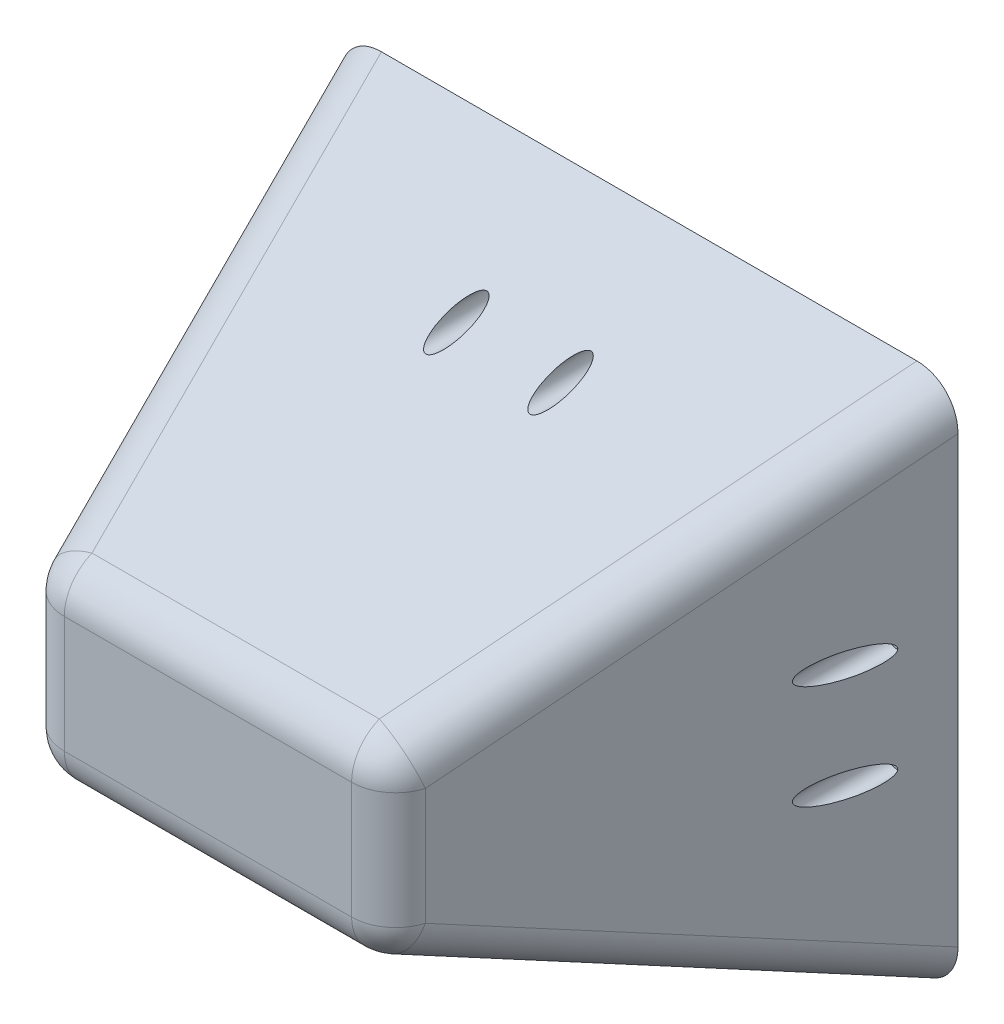
ISO-10303-21;
HEADER;
FILE_DESCRIPTION(('STEP AP214'),'2;1');
FILE_NAME('part.step','',(''),(''),'','','');
FILE_SCHEMA(('AUTOMOTIVE_DESIGN { 1 0 10303 214 1 1 1 1 }'));
ENDSEC;
DATA;
#1=APPLICATION_CONTEXT('core data for automotive mechanical design processes');
#2=APPLICATION_PROTOCOL_DEFINITION('international standard','automotive_design',2000,#1);
#3=PRODUCT_CONTEXT('',#1,'mechanical');
#4=PRODUCT('Part','Part','',(#3));
#5=PRODUCT_RELATED_PRODUCT_CATEGORY('part','',(#4));
#6=PRODUCT_DEFINITION_FORMATION('','',#4);
#7=PRODUCT_DEFINITION_CONTEXT('part definition',#1,'design');
#8=PRODUCT_DEFINITION('design','',#6,#7);
#9=PRODUCT_DEFINITION_SHAPE('','',#8);
#10=(LENGTH_UNIT() NAMED_UNIT(*) SI_UNIT(.MILLI.,.METRE.));
#11=(NAMED_UNIT(*) PLANE_ANGLE_UNIT() SI_UNIT($,.RADIAN.));
#12=(NAMED_UNIT(*) SI_UNIT($,.STERADIAN.) SOLID_ANGLE_UNIT());
#13=UNCERTAINTY_MEASURE_WITH_UNIT(LENGTH_MEASURE(1.E-05),#10,'distance_accuracy_value','');
#14=(GEOMETRIC_REPRESENTATION_CONTEXT(3) GLOBAL_UNCERTAINTY_ASSIGNED_CONTEXT((#13)) GLOBAL_UNIT_ASSIGNED_CONTEXT((#10,
#11,#12)) REPRESENTATION_CONTEXT('',''));
#15=CARTESIAN_POINT('',(0.,0.,0.));
#16=DIRECTION('',(0.,0.,1.));
#17=DIRECTION('',(1.,0.,0.));
#18=AXIS2_PLACEMENT_3D('',#15,#16,#17);
#19=CARTESIAN_POINT('',(0.,0.,254.));
#20=DIRECTION('',(0.,0.,1.));
#21=DIRECTION('',(1.,0.,0.));
#22=AXIS2_PLACEMENT_3D('',#19,#20,#21);
#23=PLANE('',#22);
#24=DIRECTION('',(0.,1.,0.));
#25=VECTOR('',#24,1.);
#26=CARTESIAN_POINT('',(82.701621467374,0.,254.));
#27=LINE('',#26,#25);
#28=CARTESIAN_POINT('',(82.701621467378,-33.6033627797591,254.));
#29=VERTEX_POINT('',#28);
#30=CARTESIAN_POINT('',(82.701621467374,33.6033627797702,254.));
#31=VERTEX_POINT('',#30);
#32=EDGE_CURVE('E583',#29,#31,#27,.T.);
#33=ORIENTED_EDGE('',*,*,#32,.T.);
#34=DIRECTION('',(-1.,0.,0.));
#35=VECTOR('',#34,1.);
#36=CARTESIAN_POINT('',(0.,33.6033627797591,254.));
#37=LINE('',#36,#35);
#38=CARTESIAN_POINT('',(-82.701621467374,33.6033627797702,254.));
#39=VERTEX_POINT('',#38);
#40=EDGE_CURVE('E580',#31,#39,#37,.T.);
#41=ORIENTED_EDGE('',*,*,#40,.T.);
#42=DIRECTION('',(0.,1.,0.));
#43=VECTOR('',#42,1.);
#44=CARTESIAN_POINT('',(-82.701621467374,-26.3628172971057,254.));
#45=LINE('',#44,#43);
#46=CARTESIAN_POINT('',(-82.701621467378,-33.6033627797591,254.));
#47=VERTEX_POINT('',#46);
#48=EDGE_CURVE('E585',#39,#47,#45,.F.);
#49=ORIENTED_EDGE('',*,*,#48,.T.);
#50=DIRECTION('',(-1.,0.,0.));
#51=VECTOR('',#50,1.);
#52=CARTESIAN_POINT('',(77.9116184088897,-33.6033627797591,254.));
#53=LINE('',#52,#51);
#54=EDGE_CURVE('E587',#47,#29,#53,.F.);
#55=ORIENTED_EDGE('',*,*,#54,.T.);
#56=EDGE_LOOP('',(#33,#41,#49,#55));
#57=FACE_BOUND('',#56,.T.);
#58=ADVANCED_FACE('F44',(#57),#23,.T.);
#59=CARTESIAN_POINT('',(-24.2526985326339,109.002397220246,585.1144));
#60=DIRECTION('',(0.268328157299999,-0.357770876399998,-0.894427190999896));
#61=DIRECTION('',(0.,0.928476690885245,-0.37139067635414));
#62=AXIS2_PLACEMENT_3D('',#59,#60,#61);
#63=CYLINDRICAL_SURFACE('',#62,25.4);
#64=DIRECTION('',(0.268328157299918,-0.357770876400015,-0.894427190999913));
#65=VECTOR('',#64,1.);
#66=CARTESIAN_POINT('',(107.030409111993,-33.6033627797542,235.89863629338));
#67=LINE('',#66,#65);
#68=CARTESIAN_POINT('',(107.030409111993,-33.6033627797544,235.898636293379));
#69=VERTEX_POINT('',#68);
#70=CARTESIAN_POINT('',(177.800000000005,-127.962817297127,0.));
#71=VERTEX_POINT('',#70);
#72=EDGE_CURVE('E209',#69,#71,#67,.T.);
#73=ORIENTED_EDGE('',*,*,#72,.F.);
#74=CARTESIAN_POINT('',(82.701621467378,-33.6033627797702,228.6));
#75=DIRECTION('',(0.268328157299999,-0.357770876399998,-0.894427190999896));
#76=DIRECTION('',(0.,0.928476690885245,-0.37139067635414));
#77=AXIS2_PLACEMENT_3D('',#74,#75,#76);
#78=CIRCLE('',#77,25.4);
#79=CARTESIAN_POINT('',(82.7016214559041,-57.1866707283247,238.033323179194));
#80=VERTEX_POINT('',#79);
#81=EDGE_CURVE('E53',#69,#80,#78,.T.);
#82=ORIENTED_EDGE('',*,*,#81,.T.);
#83=DIRECTION('',(0.268328157340141,-0.357770876395795,-0.894427190989534));
#84=VECTOR('',#83,1.);
#85=CARTESIAN_POINT('',(82.7016214557608,-57.1866707281337,238.033323179672));
#86=LINE('',#85,#84);
#87=CARTESIAN_POINT('',(154.111618421193,-152.400000000011,0.));
#88=VERTEX_POINT('',#87);
#89=EDGE_CURVE('E133',#80,#88,#86,.T.);
#90=ORIENTED_EDGE('',*,*,#89,.T.);
#91=CARTESIAN_POINT('',(151.281621467386,-125.04336277978,0.));
#92=DIRECTION('',(0.,0.,1.));
#93=DIRECTION('',(0.6,-0.8,0.));
#94=AXIS2_PLACEMENT_3D('',#91,#92,#93);
#95=ELLIPSE('',#94,28.398063314248,25.4);
#96=EDGE_CURVE('E170',#88,#71,#95,.T.);
#97=ORIENTED_EDGE('',*,*,#96,.T.);
#98=EDGE_LOOP('',(#73,#82,#90,#97));
#99=FACE_BOUND('',#98,.T.);
#100=ADVANCED_FACE('F341',(#99),#63,.T.);
#101=CARTESIAN_POINT('',(139.7,0.,127.));
#102=DIRECTION('',(0.957826285221168,0.,0.28734788556629));
#103=DIRECTION('',(0.28734788556629,0.,-0.957826285221168));
#104=AXIS2_PLACEMENT_3D('',#101,#102,#103);
#105=PLANE('',#104);
#106=CARTESIAN_POINT('',(162.799999999995,-30.,49.999999999999));
#107=DIRECTION('',(0.957826285221168,0.,0.28734788556629));
#108=DIRECTION('',(0.28734788556629,0.,-0.957826285221168));
#109=AXIS2_PLACEMENT_3D('',#106,#107,#108);
#110=ELLIPSE('',#109,24.3607151874627,7.00000000000001);
#111=CARTESIAN_POINT('',(169.799999999995,-30.,26.6666666666607));
#112=VERTEX_POINT('',#111);
#113=EDGE_CURVE('E511',#112,#112,#110,.T.);
#114=ORIENTED_EDGE('',*,*,#113,.F.);
#115=EDGE_LOOP('',(#114));
#116=FACE_BOUND('',#115,.T.);
#117=CARTESIAN_POINT('',(162.799999999995,30.,49.9999999999989));
#118=DIRECTION('',(0.957826285221168,0.,0.28734788556629));
#119=DIRECTION('',(0.28734788556629,0.,-0.957826285221168));
#120=AXIS2_PLACEMENT_3D('',#117,#118,#119);
#121=ELLIPSE('',#120,24.3607151874627,7.00000000000002);
#122=CARTESIAN_POINT('',(169.799999999996,30.,26.6666666666606));
#123=VERTEX_POINT('',#122);
#124=EDGE_CURVE('E546',#123,#123,#121,.T.);
#125=ORIENTED_EDGE('',*,*,#124,.F.);
#126=EDGE_LOOP('',(#125));
#127=FACE_BOUND('',#126,.T.);
#128=DIRECTION('',(0.268328157299999,0.357770876399998,-0.894427190999896));
#129=VECTOR('',#128,1.);
#130=CARTESIAN_POINT('',(0.0760891121439587,-109.002397221707,592.41303629285));
#131=LINE('',#130,#129);
#132=CARTESIAN_POINT('',(107.030409112016,33.6033627781222,235.898636293316));
#133=VERTEX_POINT('',#132);
#134=CARTESIAN_POINT('',(177.800000000014,127.962817296296,1.30451205393456E-12));
#135=VERTEX_POINT('',#134);
#136=EDGE_CURVE('E204',#133,#135,#131,.T.);
#137=ORIENTED_EDGE('',*,*,#136,.F.);
#138=DIRECTION('',(0.,1.,0.));
#139=VECTOR('',#138,1.);
#140=CARTESIAN_POINT('',(107.030409111992,0.,235.898636293384));
#141=LINE('',#140,#139);
#142=EDGE_CURVE('E68',#133,#69,#141,.F.);
#143=ORIENTED_EDGE('',*,*,#142,.T.);
#144=ORIENTED_EDGE('',*,*,#72,.T.);
#145=DIRECTION('',(0.,1.,0.));
#146=VECTOR('',#145,1.);
#147=CARTESIAN_POINT('',(177.8,0.,0.));
#148=LINE('',#147,#146);
#149=EDGE_CURVE('E165',#71,#135,#148,.T.);
#150=ORIENTED_EDGE('',*,*,#149,.T.);
#151=EDGE_LOOP('',(#137,#143,#144,#150));
#152=FACE_BOUND('',#151,.T.);
#153=ADVANCED_FACE('F351',(#116,#127,#152),#105,.T.);
#154=CARTESIAN_POINT('',(-24.2526985326339,-109.002397220246,585.1144));
#155=DIRECTION('',(0.268328157299999,0.357770876399998,-0.894427190999896));
#156=DIRECTION('',(0.,0.928476690885245,0.37139067635414));
#157=AXIS2_PLACEMENT_3D('',#154,#155,#156);
#158=CYLINDRICAL_SURFACE('',#157,25.4);
#159=DIRECTION('',(0.268328157299953,0.357770876399952,-0.894427190999928));
#160=VECTOR('',#159,1.);
#161=CARTESIAN_POINT('',(82.7016214673686,57.186670728244,238.033323179396));
#162=LINE('',#161,#160);
#163=CARTESIAN_POINT('',(82.7016214673694,57.186670728245,238.033323179393));
#164=VERTEX_POINT('',#163);
#165=CARTESIAN_POINT('',(154.111618421193,152.400000000011,0.));
#166=VERTEX_POINT('',#165);
#167=EDGE_CURVE('E191',#164,#166,#162,.T.);
#168=ORIENTED_EDGE('',*,*,#167,.F.);
#169=CARTESIAN_POINT('',(82.701621467378,33.6033627797702,228.6));
#170=DIRECTION('',(0.268328157299999,0.357770876399998,-0.894427190999896));
#171=DIRECTION('',(0.,0.928476690885245,0.37139067635414));
#172=AXIS2_PLACEMENT_3D('',#169,#170,#171);
#173=CIRCLE('',#172,25.4);
#174=EDGE_CURVE('E194',#164,#133,#173,.T.);
#175=ORIENTED_EDGE('',*,*,#174,.T.);
#176=ORIENTED_EDGE('',*,*,#136,.T.);
#177=CARTESIAN_POINT('',(151.281621467386,125.04336277978,0.));
#178=DIRECTION('',(0.,0.,1.));
#179=DIRECTION('',(0.6,0.8,0.));
#180=AXIS2_PLACEMENT_3D('',#177,#178,#179);
#181=ELLIPSE('',#180,28.398063314248,25.4);
#182=EDGE_CURVE('E164',#135,#166,#181,.T.);
#183=ORIENTED_EDGE('',*,*,#182,.T.);
#184=EDGE_LOOP('',(#168,#175,#176,#183));
#185=FACE_BOUND('',#184,.T.);
#186=ADVANCED_FACE('F632',(#185),#158,.T.);
#187=CARTESIAN_POINT('',(0.,101.6,127.));
#188=DIRECTION('',(0.,0.928476690885266,0.371390676354087));
#189=DIRECTION('',(0.,-0.371390676354087,0.928476690885266));
#190=AXIS2_PLACEMENT_3D('',#187,#188,#189);
#191=PLANE('',#190);
#192=CARTESIAN_POINT('',(-30.,120.,80.9999999999972));
#193=DIRECTION('',(0.,0.928476690885266,0.371390676354087));
#194=DIRECTION('',(0.,0.371390676354087,-0.928476690885266));
#195=AXIS2_PLACEMENT_3D('',#192,#193,#194);
#196=ELLIPSE('',#195,18.8480768249716,7.);
#197=CARTESIAN_POINT('',(-30.,127.,63.4999999999963));
#198=VERTEX_POINT('',#197);
#199=EDGE_CURVE('E532',#198,#198,#196,.T.);
#200=ORIENTED_EDGE('',*,*,#199,.F.);
#201=EDGE_LOOP('',(#200));
#202=FACE_BOUND('',#201,.T.);
#203=CARTESIAN_POINT('',(30.,120.,80.9999999999973));
#204=DIRECTION('',(0.,0.928476690885266,0.371390676354087));
#205=DIRECTION('',(0.,0.371390676354087,-0.928476690885266));
#206=AXIS2_PLACEMENT_3D('',#203,#204,#205);
#207=ELLIPSE('',#206,18.8480768249716,7.);
#208=CARTESIAN_POINT('',(30.,127.,63.4999999999963));
#209=VERTEX_POINT('',#208);
#210=EDGE_CURVE('E539',#209,#209,#207,.T.);
#211=ORIENTED_EDGE('',*,*,#210,.F.);
#212=EDGE_LOOP('',(#211));
#213=FACE_BOUND('',#212,.T.);
#214=DIRECTION('',(-0.268328157299999,0.357770876399947,-0.894427190999916));
#215=VECTOR('',#214,1.);
#216=CARTESIAN_POINT('',(-82.7016214664636,57.1866707270265,238.03332318244));
#217=LINE('',#216,#215);
#218=CARTESIAN_POINT('',(-82.7016214673774,57.1866707282449,238.033323179394));
#219=VERTEX_POINT('',#218);
#220=CARTESIAN_POINT('',(-154.111618421203,152.400000000011,0.));
#221=VERTEX_POINT('',#220);
#222=EDGE_CURVE('E186',#219,#221,#217,.T.);
#223=ORIENTED_EDGE('',*,*,#222,.F.);
#224=DIRECTION('',(-1.,0.,0.));
#225=VECTOR('',#224,1.);
#226=CARTESIAN_POINT('',(0.,57.1866707282449,238.033323179394));
#227=LINE('',#226,#225);
#228=EDGE_CURVE('E578',#219,#164,#227,.F.);
#229=ORIENTED_EDGE('',*,*,#228,.T.);
#230=ORIENTED_EDGE('',*,*,#167,.T.);
#231=DIRECTION('',(1.,0.,0.));
#232=VECTOR('',#231,1.);
#233=CARTESIAN_POINT('',(0.,152.4,0.));
#234=LINE('',#233,#232);
#235=EDGE_CURVE('E155',#166,#221,#234,.F.);
#236=ORIENTED_EDGE('',*,*,#235,.T.);
#237=EDGE_LOOP('',(#223,#229,#230,#236));
#238=FACE_BOUND('',#237,.T.);
#239=ADVANCED_FACE('F286',(#202,#213,#238),#191,.T.);
#240=CARTESIAN_POINT('',(24.2526985326339,-109.002397220246,585.1144));
#241=DIRECTION('',(-0.268328157299999,0.357770876399998,-0.894427190999896));
#242=DIRECTION('',(0.,0.928476690885245,0.37139067635414));
#243=AXIS2_PLACEMENT_3D('',#240,#241,#242);
#244=CYLINDRICAL_SURFACE('',#243,25.4);
#245=DIRECTION('',(0.268328157299918,-0.357770876400015,0.894427190999913));
#246=VECTOR('',#245,1.);
#247=CARTESIAN_POINT('',(-177.799999999993,127.96281729712,-2.19269047363468E-12));
#248=LINE('',#247,#246);
#249=CARTESIAN_POINT('',(-177.800000000005,127.962817297127,0.));
#250=VERTEX_POINT('',#249);
#251=CARTESIAN_POINT('',(-107.030409111992,33.6033627797528,235.898636293383));
#252=VERTEX_POINT('',#251);
#253=EDGE_CURVE('E134',#250,#252,#248,.T.);
#254=ORIENTED_EDGE('',*,*,#253,.T.);
#255=CARTESIAN_POINT('',(-82.701621467378,33.6033627797702,228.6));
#256=DIRECTION('',(-0.268328157299999,0.357770876399998,-0.894427190999896));
#257=DIRECTION('',(0.,0.928476690885245,0.37139067635414));
#258=AXIS2_PLACEMENT_3D('',#255,#256,#257);
#259=CIRCLE('',#258,25.4);
#260=EDGE_CURVE('E589',#252,#219,#259,.T.);
#261=ORIENTED_EDGE('',*,*,#260,.T.);
#262=ORIENTED_EDGE('',*,*,#222,.T.);
#263=CARTESIAN_POINT('',(-151.281621467386,125.04336277978,0.));
#264=DIRECTION('',(0.,0.,1.));
#265=DIRECTION('',(-0.6,0.8,0.));
#266=AXIS2_PLACEMENT_3D('',#263,#264,#265);
#267=ELLIPSE('',#266,28.398063314248,25.4);
#268=EDGE_CURVE('E151',#221,#250,#267,.T.);
#269=ORIENTED_EDGE('',*,*,#268,.T.);
#270=EDGE_LOOP('',(#254,#261,#262,#269));
#271=FACE_BOUND('',#270,.T.);
#272=ADVANCED_FACE('F281',(#271),#244,.T.);
#273=CARTESIAN_POINT('',(-139.7,0.,127.));
#274=DIRECTION('',(0.957826285221168,0.,-0.28734788556629));
#275=DIRECTION('',(-0.28734788556629,0.,-0.957826285221168));
#276=AXIS2_PLACEMENT_3D('',#273,#274,#275);
#277=PLANE('',#276);
#278=CARTESIAN_POINT('',(-162.800000000014,-30.,49.9999999999386));
#279=DIRECTION('',(0.957826285221168,0.,-0.28734788556629));
#280=DIRECTION('',(-0.28734788556629,0.,-0.957826285221168));
#281=AXIS2_PLACEMENT_3D('',#278,#279,#280);
#282=ELLIPSE('',#281,24.3607151874627,7.00000000000001);
#283=CARTESIAN_POINT('',(-169.800000000014,-30.,26.6666666666003));
#284=VERTEX_POINT('',#283);
#285=EDGE_CURVE('E518',#284,#284,#282,.T.);
#286=ORIENTED_EDGE('',*,*,#285,.T.);
#287=EDGE_LOOP('',(#286));
#288=FACE_BOUND('',#287,.T.);
#289=CARTESIAN_POINT('',(-162.800000000023,30.,49.999999999906));
#290=DIRECTION('',(0.957826285221168,0.,-0.28734788556629));
#291=DIRECTION('',(-0.28734788556629,0.,-0.957826285221168));
#292=AXIS2_PLACEMENT_3D('',#289,#290,#291);
#293=ELLIPSE('',#292,24.3607151874627,7.00000000000002);
#294=CARTESIAN_POINT('',(-169.800000000023,30.,26.6666666665677));
#295=VERTEX_POINT('',#294);
#296=EDGE_CURVE('E525',#295,#295,#293,.T.);
#297=ORIENTED_EDGE('',*,*,#296,.T.);
#298=EDGE_LOOP('',(#297));
#299=FACE_BOUND('',#298,.T.);
#300=DIRECTION('',(-0.268328157299999,-0.357770876399998,-0.894427190999896));
#301=VECTOR('',#300,1.);
#302=CARTESIAN_POINT('',(-0.0760891119848117,109.002397220261,592.41303629338));
#303=LINE('',#302,#301);
#304=CARTESIAN_POINT('',(-107.030409111996,-33.6033627797528,235.898636293384));
#305=VERTEX_POINT('',#304);
#306=CARTESIAN_POINT('',(-177.800000000014,-127.962817297125,1.27675647831893E-12));
#307=VERTEX_POINT('',#306);
#308=EDGE_CURVE('E122',#305,#307,#303,.T.);
#309=ORIENTED_EDGE('',*,*,#308,.F.);
#310=DIRECTION('',(0.,1.,0.));
#311=VECTOR('',#310,1.);
#312=CARTESIAN_POINT('',(-107.030409111992,26.3628172971237,235.898636293384));
#313=LINE('',#312,#311);
#314=EDGE_CURVE('E575',#305,#252,#313,.T.);
#315=ORIENTED_EDGE('',*,*,#314,.T.);
#316=ORIENTED_EDGE('',*,*,#253,.F.);
#317=DIRECTION('',(0.,1.,0.));
#318=VECTOR('',#317,1.);
#319=CARTESIAN_POINT('',(-177.8,0.,0.));
#320=LINE('',#319,#318);
#321=EDGE_CURVE('E141',#250,#307,#320,.F.);
#322=ORIENTED_EDGE('',*,*,#321,.T.);
#323=EDGE_LOOP('',(#309,#315,#316,#322));
#324=FACE_BOUND('',#323,.T.);
#325=ADVANCED_FACE('F148',(#288,#299,#324),#277,.F.);
#326=CARTESIAN_POINT('',(24.2526985326339,109.002397220246,585.1144));
#327=DIRECTION('',(-0.268328157299999,-0.357770876399998,-0.894427190999896));
#328=DIRECTION('',(0.,0.928476690885245,-0.37139067635414));
#329=AXIS2_PLACEMENT_3D('',#326,#327,#328);
#330=CYLINDRICAL_SURFACE('',#329,25.4);
#331=DIRECTION('',(0.268328157299953,0.357770876399952,0.894427190999928));
#332=VECTOR('',#331,1.);
#333=CARTESIAN_POINT('',(-154.111618421181,-152.399999999998,-9.71445146547012E-13));
#334=LINE('',#333,#332);
#335=CARTESIAN_POINT('',(-154.111618421193,-152.400000000011,0.));
#336=VERTEX_POINT('',#335);
#337=CARTESIAN_POINT('',(-82.7016214673693,-57.186670728245,238.033323179394));
#338=VERTEX_POINT('',#337);
#339=EDGE_CURVE('E171',#336,#338,#334,.T.);
#340=ORIENTED_EDGE('',*,*,#339,.T.);
#341=CARTESIAN_POINT('',(-82.701621467378,-33.6033627797702,228.6));
#342=DIRECTION('',(-0.268328157299999,-0.357770876399998,-0.894427190999896));
#343=DIRECTION('',(0.,0.928476690885245,-0.37139067635414));
#344=AXIS2_PLACEMENT_3D('',#341,#342,#343);
#345=CIRCLE('',#344,25.4);
#346=EDGE_CURVE('E128',#338,#305,#345,.T.);
#347=ORIENTED_EDGE('',*,*,#346,.T.);
#348=ORIENTED_EDGE('',*,*,#308,.T.);
#349=CARTESIAN_POINT('',(-151.281621467386,-125.04336277978,0.));
#350=DIRECTION('',(0.,0.,1.));
#351=DIRECTION('',(-0.6,-0.8,0.));
#352=AXIS2_PLACEMENT_3D('',#349,#350,#351);
#353=ELLIPSE('',#352,28.398063314248,25.4);
#354=EDGE_CURVE('E126',#307,#336,#353,.T.);
#355=ORIENTED_EDGE('',*,*,#354,.T.);
#356=EDGE_LOOP('',(#340,#347,#348,#355));
#357=FACE_BOUND('',#356,.T.);
#358=ADVANCED_FACE('F125',(#357),#330,.T.);
#359=CARTESIAN_POINT('',(0.,-101.6,127.));
#360=DIRECTION('',(0.,0.928476690885266,-0.371390676354087));
#361=DIRECTION('',(0.,0.371390676354087,0.928476690885266));
#362=AXIS2_PLACEMENT_3D('',#359,#360,#361);
#363=PLANE('',#362);
#364=CARTESIAN_POINT('',(-30.,-120.,80.9999999999978));
#365=DIRECTION('',(0.,0.928476690885266,-0.371390676354087));
#366=DIRECTION('',(0.,-0.371390676354087,-0.928476690885266));
#367=AXIS2_PLACEMENT_3D('',#364,#365,#366);
#368=ELLIPSE('',#367,18.8480768249716,7.);
#369=CARTESIAN_POINT('',(-30.,-127.,63.4999999999968));
#370=VERTEX_POINT('',#369);
#371=EDGE_CURVE('E48',#370,#370,#368,.T.);
#372=ORIENTED_EDGE('',*,*,#371,.T.);
#373=EDGE_LOOP('',(#372));
#374=FACE_BOUND('',#373,.T.);
#375=CARTESIAN_POINT('',(30.,-120.,80.9999999999978));
#376=DIRECTION('',(0.,0.928476690885266,-0.371390676354087));
#377=DIRECTION('',(0.,-0.371390676354087,-0.928476690885266));
#378=AXIS2_PLACEMENT_3D('',#375,#376,#377);
#379=ELLIPSE('',#378,18.8480768249716,7.);
#380=CARTESIAN_POINT('',(30.,-127.,63.4999999999968));
#381=VERTEX_POINT('',#380);
#382=EDGE_CURVE('E504',#381,#381,#379,.T.);
#383=ORIENTED_EDGE('',*,*,#382,.T.);
#384=EDGE_LOOP('',(#383));
#385=FACE_BOUND('',#384,.T.);
#386=ORIENTED_EDGE('',*,*,#89,.F.);
#387=DIRECTION('',(-1.,0.,0.));
#388=VECTOR('',#387,1.);
#389=CARTESIAN_POINT('',(-77.911618421196,-57.1866707282449,238.033323179394));
#390=LINE('',#389,#388);
#391=EDGE_CURVE('E13',#80,#338,#390,.T.);
#392=ORIENTED_EDGE('',*,*,#391,.T.);
#393=ORIENTED_EDGE('',*,*,#339,.F.);
#394=DIRECTION('',(1.,0.,0.));
#395=VECTOR('',#394,1.);
#396=CARTESIAN_POINT('',(0.,-152.4,0.));
#397=LINE('',#396,#395);
#398=EDGE_CURVE('E145',#336,#88,#397,.T.);
#399=ORIENTED_EDGE('',*,*,#398,.T.);
#400=EDGE_LOOP('',(#386,#392,#393,#399));
#401=FACE_BOUND('',#400,.T.);
#402=ADVANCED_FACE('F276',(#374,#385,#401),#363,.F.);
#403=CARTESIAN_POINT('',(0.,0.,0.));
#404=DIRECTION('',(0.,0.,1.));
#405=DIRECTION('',(1.,0.,0.));
#406=AXIS2_PLACEMENT_3D('',#403,#404,#405);
#407=PLANE('',#406);
#408=CARTESIAN_POINT('',(-162.800000000023,30.,0.));
#409=DIRECTION('',(0.,0.,-1.));
#410=DIRECTION('',(-1.,0.,0.));
#411=AXIS2_PLACEMENT_3D('',#408,#409,#410);
#412=CIRCLE('',#411,4.49999999999996);
#413=CARTESIAN_POINT('',(-167.300000000023,30.,0.));
#414=VERTEX_POINT('',#413);
#415=EDGE_CURVE('E549',#414,#414,#412,.T.);
#416=ORIENTED_EDGE('',*,*,#415,.F.);
#417=EDGE_LOOP('',(#416));
#418=FACE_BOUND('',#417,.T.);
#419=CARTESIAN_POINT('',(-162.800000000014,-30.,0.));
#420=DIRECTION('',(0.,0.,-1.));
#421=DIRECTION('',(-1.,0.,0.));
#422=AXIS2_PLACEMENT_3D('',#419,#420,#421);
#423=CIRCLE('',#422,4.49999999999996);
#424=CARTESIAN_POINT('',(-167.300000000014,-30.,0.));
#425=VERTEX_POINT('',#424);
#426=EDGE_CURVE('E688',#425,#425,#423,.T.);
#427=ORIENTED_EDGE('',*,*,#426,.F.);
#428=EDGE_LOOP('',(#427));
#429=FACE_BOUND('',#428,.T.);
#430=CARTESIAN_POINT('',(-30.,-120.,0.));
#431=DIRECTION('',(0.,0.,-1.));
#432=DIRECTION('',(-1.,0.,0.));
#433=AXIS2_PLACEMENT_3D('',#430,#431,#432);
#434=CIRCLE('',#433,4.5);
#435=CARTESIAN_POINT('',(-34.5,-120.,0.));
#436=VERTEX_POINT('',#435);
#437=EDGE_CURVE('E691',#436,#436,#434,.T.);
#438=ORIENTED_EDGE('',*,*,#437,.F.);
#439=EDGE_LOOP('',(#438));
#440=FACE_BOUND('',#439,.T.);
#441=CARTESIAN_POINT('',(30.,-120.,0.));
#442=DIRECTION('',(0.,0.,-1.));
#443=DIRECTION('',(-1.,0.,0.));
#444=AXIS2_PLACEMENT_3D('',#441,#442,#443);
#445=CIRCLE('',#444,4.49999999999237);
#446=CARTESIAN_POINT('',(25.5000000000076,-120.,0.));
#447=VERTEX_POINT('',#446);
#448=EDGE_CURVE('E694',#447,#447,#445,.T.);
#449=ORIENTED_EDGE('',*,*,#448,.F.);
#450=EDGE_LOOP('',(#449));
#451=FACE_BOUND('',#450,.T.);
#452=CARTESIAN_POINT('',(-30.,120.,0.));
#453=DIRECTION('',(0.,0.,-1.));
#454=DIRECTION('',(-1.,0.,0.));
#455=AXIS2_PLACEMENT_3D('',#452,#453,#454);
#456=CIRCLE('',#455,4.49999999999242);
#457=CARTESIAN_POINT('',(-34.4999999999924,120.,0.));
#458=VERTEX_POINT('',#457);
#459=EDGE_CURVE('E697',#458,#458,#456,.T.);
#460=ORIENTED_EDGE('',*,*,#459,.F.);
#461=EDGE_LOOP('',(#460));
#462=FACE_BOUND('',#461,.T.);
#463=CARTESIAN_POINT('',(30.,120.,0.));
#464=DIRECTION('',(0.,0.,-1.));
#465=DIRECTION('',(-1.,0.,0.));
#466=AXIS2_PLACEMENT_3D('',#463,#464,#465);
#467=CIRCLE('',#466,4.49999999999235);
#468=CARTESIAN_POINT('',(25.5000000000076,120.,0.));
#469=VERTEX_POINT('',#468);
#470=EDGE_CURVE('E700',#469,#469,#467,.T.);
#471=ORIENTED_EDGE('',*,*,#470,.F.);
#472=EDGE_LOOP('',(#471));
#473=FACE_BOUND('',#472,.T.);
#474=CARTESIAN_POINT('',(162.799999999995,-30.,0.));
#475=DIRECTION('',(0.,0.,-1.));
#476=DIRECTION('',(-1.,0.,0.));
#477=AXIS2_PLACEMENT_3D('',#474,#475,#476);
#478=CIRCLE('',#477,4.49999999999519);
#479=CARTESIAN_POINT('',(158.3,-30.,0.));
#480=VERTEX_POINT('',#479);
#481=EDGE_CURVE('E703',#480,#480,#478,.T.);
#482=ORIENTED_EDGE('',*,*,#481,.F.);
#483=EDGE_LOOP('',(#482));
#484=FACE_BOUND('',#483,.T.);
#485=CARTESIAN_POINT('',(162.799999999995,30.,0.));
#486=DIRECTION('',(0.,0.,-1.));
#487=DIRECTION('',(-1.,0.,0.));
#488=AXIS2_PLACEMENT_3D('',#485,#486,#487);
#489=CIRCLE('',#488,4.49999999999999);
#490=CARTESIAN_POINT('',(158.299999999995,30.,0.));
#491=VERTEX_POINT('',#490);
#492=EDGE_CURVE('E572',#491,#491,#489,.T.);
#493=ORIENTED_EDGE('',*,*,#492,.F.);
#494=EDGE_LOOP('',(#493));
#495=FACE_BOUND('',#494,.T.);
#496=ORIENTED_EDGE('',*,*,#354,.F.);
#497=ORIENTED_EDGE('',*,*,#321,.F.);
#498=ORIENTED_EDGE('',*,*,#268,.F.);
#499=ORIENTED_EDGE('',*,*,#235,.F.);
#500=ORIENTED_EDGE('',*,*,#182,.F.);
#501=ORIENTED_EDGE('',*,*,#149,.F.);
#502=ORIENTED_EDGE('',*,*,#96,.F.);
#503=ORIENTED_EDGE('',*,*,#398,.F.);
#504=EDGE_LOOP('',(#496,#497,#498,#499,#500,#501,#502,#503));
#505=FACE_BOUND('',#504,.T.);
#506=ADVANCED_FACE('F139',(#418,#429,#440,#451,#462,#473,#484,#495,#505),#407,.F.);
#507=CARTESIAN_POINT('',(-82.701621467378,-33.6033627797702,228.6));
#508=DIRECTION('',(0.,0.,1.));
#509=DIRECTION('',(1.,0.,0.));
#510=AXIS2_PLACEMENT_3D('',#507,#508,#509);
#511=SPHERICAL_SURFACE('',#510,25.4);
#512=CARTESIAN_POINT('',(-82.701621467378,-33.6033627797702,228.6));
#513=DIRECTION('',(1.,3.16001981955835E-13,0.));
#514=DIRECTION('',(-3.16001981955835E-13,1.,0.));
#515=AXIS2_PLACEMENT_3D('',#512,#513,#514);
#516=CIRCLE('',#515,25.4);
#517=EDGE_CURVE('E554',#47,#338,#516,.T.);
#518=ORIENTED_EDGE('',*,*,#517,.F.);
#519=CARTESIAN_POINT('',(-82.7016214673781,-33.6033627797702,228.6));
#520=DIRECTION('',(6.47594849252787E-13,1.,0.));
#521=DIRECTION('',(-1.,6.47594849252787E-13,0.));
#522=AXIS2_PLACEMENT_3D('',#519,#520,#521);
#523=CIRCLE('',#522,25.4);
#524=EDGE_CURVE('E215',#305,#47,#523,.T.);
#525=ORIENTED_EDGE('',*,*,#524,.F.);
#526=ORIENTED_EDGE('',*,*,#346,.F.);
#527=EDGE_LOOP('',(#518,#525,#526));
#528=FACE_BOUND('',#527,.T.);
#529=ADVANCED_FACE('F46',(#528),#511,.T.);
#530=CARTESIAN_POINT('',(-82.701621467374,0.,228.6));
#531=DIRECTION('',(0.,-1.,0.));
#532=DIRECTION('',(0.,0.,-1.));
#533=AXIS2_PLACEMENT_3D('',#530,#531,#532);
#534=CYLINDRICAL_SURFACE('',#533,25.4);
#535=ORIENTED_EDGE('',*,*,#524,.T.);
#536=ORIENTED_EDGE('',*,*,#48,.F.);
#537=CARTESIAN_POINT('',(-82.701621467374,33.6033627797544,228.6));
#538=DIRECTION('',(-1.85874937488878E-13,1.,-6.19583124963055E-13));
#539=DIRECTION('',(0.,6.19583124963055E-13,1.));
#540=AXIS2_PLACEMENT_3D('',#537,#538,#539);
#541=CIRCLE('',#540,25.4);
#542=EDGE_CURVE('E557',#252,#39,#541,.T.);
#543=ORIENTED_EDGE('',*,*,#542,.F.);
#544=ORIENTED_EDGE('',*,*,#314,.F.);
#545=EDGE_LOOP('',(#535,#536,#543,#544));
#546=FACE_BOUND('',#545,.T.);
#547=ADVANCED_FACE('F379',(#546),#534,.T.);
#548=CARTESIAN_POINT('',(0.,-33.6033627797591,228.6));
#549=DIRECTION('',(1.,0.,0.));
#550=DIRECTION('',(0.,0.,-1.));
#551=AXIS2_PLACEMENT_3D('',#548,#549,#550);
#552=CYLINDRICAL_SURFACE('',#551,25.4);
#553=ORIENTED_EDGE('',*,*,#517,.T.);
#554=ORIENTED_EDGE('',*,*,#391,.F.);
#555=CARTESIAN_POINT('',(82.701621467378,-33.6033627797591,228.6));
#556=DIRECTION('',(1.,-4.53824745817806E-10,0.));
#557=DIRECTION('',(4.53824745817806E-10,1.,0.));
#558=AXIS2_PLACEMENT_3D('',#555,#556,#557);
#559=CIRCLE('',#558,25.4);
#560=EDGE_CURVE('E560',#29,#80,#559,.T.);
#561=ORIENTED_EDGE('',*,*,#560,.F.);
#562=ORIENTED_EDGE('',*,*,#54,.F.);
#563=EDGE_LOOP('',(#553,#554,#561,#562));
#564=FACE_BOUND('',#563,.T.);
#565=ADVANCED_FACE('F376',(#564),#552,.T.);
#566=CARTESIAN_POINT('',(-82.701621467378,33.6033627797702,228.6));
#567=DIRECTION('',(0.,0.,1.));
#568=DIRECTION('',(1.,0.,0.));
#569=AXIS2_PLACEMENT_3D('',#566,#567,#568);
#570=SPHERICAL_SURFACE('',#569,25.4);
#571=ORIENTED_EDGE('',*,*,#260,.F.);
#572=ORIENTED_EDGE('',*,*,#542,.T.);
#573=CARTESIAN_POINT('',(-82.701621467378,33.6033627797702,228.6));
#574=DIRECTION('',(1.,0.,0.));
#575=DIRECTION('',(0.,1.,0.));
#576=AXIS2_PLACEMENT_3D('',#573,#574,#575);
#577=CIRCLE('',#576,25.4);
#578=EDGE_CURVE('E563',#219,#39,#577,.T.);
#579=ORIENTED_EDGE('',*,*,#578,.F.);
#580=EDGE_LOOP('',(#571,#572,#579));
#581=FACE_BOUND('',#580,.T.);
#582=ADVANCED_FACE('F372',(#581),#570,.T.);
#583=CARTESIAN_POINT('',(82.701621467378,-33.6033627797702,228.6));
#584=DIRECTION('',(0.,0.,1.));
#585=DIRECTION('',(1.,0.,0.));
#586=AXIS2_PLACEMENT_3D('',#583,#584,#585);
#587=SPHERICAL_SURFACE('',#586,25.4);
#588=ORIENTED_EDGE('',*,*,#560,.T.);
#589=ORIENTED_EDGE('',*,*,#81,.F.);
#590=CARTESIAN_POINT('',(82.701621467378,-33.6033627797702,228.6));
#591=DIRECTION('',(-6.4629334662846E-13,1.,0.));
#592=DIRECTION('',(-1.,-6.4629334662846E-13,0.));
#593=AXIS2_PLACEMENT_3D('',#590,#591,#592);
#594=CIRCLE('',#593,25.4);
#595=EDGE_CURVE('E565',#29,#69,#594,.T.);
#596=ORIENTED_EDGE('',*,*,#595,.F.);
#597=EDGE_LOOP('',(#588,#589,#596));
#598=FACE_BOUND('',#597,.T.);
#599=ADVANCED_FACE('F368',(#598),#587,.T.);
#600=CARTESIAN_POINT('',(0.,33.6033627797591,228.6));
#601=DIRECTION('',(-1.,0.,0.));
#602=DIRECTION('',(0.,0.,1.));
#603=AXIS2_PLACEMENT_3D('',#600,#601,#602);
#604=CYLINDRICAL_SURFACE('',#603,25.4);
#605=ORIENTED_EDGE('',*,*,#578,.T.);
#606=ORIENTED_EDGE('',*,*,#40,.F.);
#607=CARTESIAN_POINT('',(82.7016214673706,33.6033627797591,228.6));
#608=DIRECTION('',(1.,1.1736018980781E-13,-2.93400474519542E-13));
#609=DIRECTION('',(-2.93400474519542E-13,0.,-1.));
#610=AXIS2_PLACEMENT_3D('',#607,#608,#609);
#611=CIRCLE('',#610,25.4);
#612=EDGE_CURVE('E568',#164,#31,#611,.T.);
#613=ORIENTED_EDGE('',*,*,#612,.F.);
#614=ORIENTED_EDGE('',*,*,#228,.F.);
#615=EDGE_LOOP('',(#605,#606,#613,#614));
#616=FACE_BOUND('',#615,.T.);
#617=ADVANCED_FACE('F364',(#616),#604,.T.);
#618=CARTESIAN_POINT('',(82.701621467374,0.,228.6));
#619=DIRECTION('',(0.,1.,0.));
#620=DIRECTION('',(0.,0.,1.));
#621=AXIS2_PLACEMENT_3D('',#618,#619,#620);
#622=CYLINDRICAL_SURFACE('',#621,25.4);
#623=ORIENTED_EDGE('',*,*,#595,.T.);
#624=ORIENTED_EDGE('',*,*,#142,.F.);
#625=CARTESIAN_POINT('',(82.701621467374,33.6033627797702,228.6));
#626=DIRECTION('',(6.00639253073845E-11,1.,0.));
#627=DIRECTION('',(-1.,6.00639253073845E-11,0.));
#628=AXIS2_PLACEMENT_3D('',#625,#626,#627);
#629=CIRCLE('',#628,25.4);
#630=EDGE_CURVE('E571',#31,#133,#629,.T.);
#631=ORIENTED_EDGE('',*,*,#630,.F.);
#632=ORIENTED_EDGE('',*,*,#32,.F.);
#633=EDGE_LOOP('',(#623,#624,#631,#632));
#634=FACE_BOUND('',#633,.T.);
#635=ADVANCED_FACE('F360',(#634),#622,.T.);
#636=CARTESIAN_POINT('',(82.701621467378,33.6033627797702,228.6));
#637=DIRECTION('',(0.,0.,1.));
#638=DIRECTION('',(1.,0.,0.));
#639=AXIS2_PLACEMENT_3D('',#636,#637,#638);
#640=SPHERICAL_SURFACE('',#639,25.4);
#641=ORIENTED_EDGE('',*,*,#174,.F.);
#642=ORIENTED_EDGE('',*,*,#612,.T.);
#643=ORIENTED_EDGE('',*,*,#630,.T.);
#644=EDGE_LOOP('',(#641,#642,#643));
#645=FACE_BOUND('',#644,.T.);
#646=ADVANCED_FACE('F356',(#645),#640,.T.);
#647=CARTESIAN_POINT('',(162.799999999995,30.,254.));
#648=DIRECTION('',(0.,0.,-1.));
#649=DIRECTION('',(-1.,0.,0.));
#650=AXIS2_PLACEMENT_3D('',#647,#648,#649);
#651=CYLINDRICAL_SURFACE('',#650,4.49999999999999);
#652=CARTESIAN_POINT('',(162.799999999995,30.,20.));
#653=DIRECTION('',(0.,0.,-1.));
#654=DIRECTION('',(-1.,0.,0.));
#655=AXIS2_PLACEMENT_3D('',#652,#653,#654);
#656=CIRCLE('',#655,4.49999999999999);
#657=CARTESIAN_POINT('',(158.299999999995,30.,20.));
#658=VERTEX_POINT('',#657);
#659=EDGE_CURVE('E550',#658,#658,#656,.F.);
#660=ORIENTED_EDGE('',*,*,#659,.T.);
#661=EDGE_LOOP('',(#660));
#662=FACE_BOUND('',#661,.T.);
#663=ORIENTED_EDGE('',*,*,#492,.T.);
#664=EDGE_LOOP('',(#663));
#665=FACE_BOUND('',#664,.T.);
#666=ADVANCED_FACE('F359',(#662,#665),#651,.F.);
#667=CARTESIAN_POINT('',(162.799999999995,-30.,254.));
#668=DIRECTION('',(0.,0.,-1.));
#669=DIRECTION('',(-1.,0.,0.));
#670=AXIS2_PLACEMENT_3D('',#667,#668,#669);
#671=CYLINDRICAL_SURFACE('',#670,4.49999999999519);
#672=CARTESIAN_POINT('',(162.799999999995,-30.,20.));
#673=DIRECTION('',(0.,0.,-1.));
#674=DIRECTION('',(-1.,0.,0.));
#675=AXIS2_PLACEMENT_3D('',#672,#673,#674);
#676=CIRCLE('',#675,4.49999999999519);
#677=CARTESIAN_POINT('',(158.3,-30.,20.));
#678=VERTEX_POINT('',#677);
#679=EDGE_CURVE('E515',#678,#678,#676,.F.);
#680=ORIENTED_EDGE('',*,*,#679,.T.);
#681=EDGE_LOOP('',(#680));
#682=FACE_BOUND('',#681,.T.);
#683=ORIENTED_EDGE('',*,*,#481,.T.);
#684=EDGE_LOOP('',(#683));
#685=FACE_BOUND('',#684,.T.);
#686=ADVANCED_FACE('F399',(#682,#685),#671,.F.);
#687=CARTESIAN_POINT('',(30.,120.,254.));
#688=DIRECTION('',(0.,0.,-1.));
#689=DIRECTION('',(-1.,0.,0.));
#690=AXIS2_PLACEMENT_3D('',#687,#688,#689);
#691=CYLINDRICAL_SURFACE('',#690,4.49999999999235);
#692=CARTESIAN_POINT('',(30.,120.,20.));
#693=DIRECTION('',(0.,0.,-1.));
#694=DIRECTION('',(-1.,0.,0.));
#695=AXIS2_PLACEMENT_3D('',#692,#693,#694);
#696=CIRCLE('',#695,4.49999999999235);
#697=CARTESIAN_POINT('',(25.5000000000076,120.,20.));
#698=VERTEX_POINT('',#697);
#699=EDGE_CURVE('E543',#698,#698,#696,.F.);
#700=ORIENTED_EDGE('',*,*,#699,.T.);
#701=EDGE_LOOP('',(#700));
#702=FACE_BOUND('',#701,.T.);
#703=ORIENTED_EDGE('',*,*,#470,.T.);
#704=EDGE_LOOP('',(#703));
#705=FACE_BOUND('',#704,.T.);
#706=ADVANCED_FACE('F403',(#702,#705),#691,.F.);
#707=CARTESIAN_POINT('',(-30.,120.,254.));
#708=DIRECTION('',(0.,0.,-1.));
#709=DIRECTION('',(-1.,0.,0.));
#710=AXIS2_PLACEMENT_3D('',#707,#708,#709);
#711=CYLINDRICAL_SURFACE('',#710,4.49999999999242);
#712=CARTESIAN_POINT('',(-30.,120.,20.));
#713=DIRECTION('',(0.,0.,-1.));
#714=DIRECTION('',(-1.,0.,0.));
#715=AXIS2_PLACEMENT_3D('',#712,#713,#714);
#716=CIRCLE('',#715,4.49999999999242);
#717=CARTESIAN_POINT('',(-34.4999999999924,120.,20.));
#718=VERTEX_POINT('',#717);
#719=EDGE_CURVE('E536',#718,#718,#716,.F.);
#720=ORIENTED_EDGE('',*,*,#719,.T.);
#721=EDGE_LOOP('',(#720));
#722=FACE_BOUND('',#721,.T.);
#723=ORIENTED_EDGE('',*,*,#459,.T.);
#724=EDGE_LOOP('',(#723));
#725=FACE_BOUND('',#724,.T.);
#726=ADVANCED_FACE('F407',(#722,#725),#711,.F.);
#727=CARTESIAN_POINT('',(30.,-120.,254.));
#728=DIRECTION('',(0.,0.,-1.));
#729=DIRECTION('',(-1.,0.,0.));
#730=AXIS2_PLACEMENT_3D('',#727,#728,#729);
#731=CYLINDRICAL_SURFACE('',#730,4.49999999999237);
#732=CARTESIAN_POINT('',(30.,-120.,20.));
#733=DIRECTION('',(0.,0.,-1.));
#734=DIRECTION('',(-1.,0.,0.));
#735=AXIS2_PLACEMENT_3D('',#732,#733,#734);
#736=CIRCLE('',#735,4.49999999999237);
#737=CARTESIAN_POINT('',(25.5000000000076,-120.,20.));
#738=VERTEX_POINT('',#737);
#739=EDGE_CURVE('E508',#738,#738,#736,.F.);
#740=ORIENTED_EDGE('',*,*,#739,.T.);
#741=EDGE_LOOP('',(#740));
#742=FACE_BOUND('',#741,.T.);
#743=ORIENTED_EDGE('',*,*,#448,.T.);
#744=EDGE_LOOP('',(#743));
#745=FACE_BOUND('',#744,.T.);
#746=ADVANCED_FACE('F411',(#742,#745),#731,.F.);
#747=CARTESIAN_POINT('',(-30.,-120.,254.));
#748=DIRECTION('',(0.,0.,-1.));
#749=DIRECTION('',(-1.,0.,0.));
#750=AXIS2_PLACEMENT_3D('',#747,#748,#749);
#751=CYLINDRICAL_SURFACE('',#750,4.5);
#752=CARTESIAN_POINT('',(-30.,-120.,20.));
#753=DIRECTION('',(0.,0.,-1.));
#754=DIRECTION('',(-1.,0.,0.));
#755=AXIS2_PLACEMENT_3D('',#752,#753,#754);
#756=CIRCLE('',#755,4.5);
#757=CARTESIAN_POINT('',(-34.5,-120.,20.));
#758=VERTEX_POINT('',#757);
#759=EDGE_CURVE('E499',#758,#758,#756,.F.);
#760=ORIENTED_EDGE('',*,*,#759,.T.);
#761=EDGE_LOOP('',(#760));
#762=FACE_BOUND('',#761,.T.);
#763=ORIENTED_EDGE('',*,*,#437,.T.);
#764=EDGE_LOOP('',(#763));
#765=FACE_BOUND('',#764,.T.);
#766=ADVANCED_FACE('F415',(#762,#765),#751,.F.);
#767=CARTESIAN_POINT('',(-162.800000000014,-30.,254.));
#768=DIRECTION('',(0.,0.,-1.));
#769=DIRECTION('',(-1.,0.,0.));
#770=AXIS2_PLACEMENT_3D('',#767,#768,#769);
#771=CYLINDRICAL_SURFACE('',#770,4.49999999999996);
#772=CARTESIAN_POINT('',(-162.800000000014,-30.,20.));
#773=DIRECTION('',(0.,0.,-1.));
#774=DIRECTION('',(-1.,0.,0.));
#775=AXIS2_PLACEMENT_3D('',#772,#773,#774);
#776=CIRCLE('',#775,4.49999999999996);
#777=CARTESIAN_POINT('',(-167.300000000014,-30.,20.));
#778=VERTEX_POINT('',#777);
#779=EDGE_CURVE('E522',#778,#778,#776,.F.);
#780=ORIENTED_EDGE('',*,*,#779,.T.);
#781=EDGE_LOOP('',(#780));
#782=FACE_BOUND('',#781,.T.);
#783=ORIENTED_EDGE('',*,*,#426,.T.);
#784=EDGE_LOOP('',(#783));
#785=FACE_BOUND('',#784,.T.);
#786=ADVANCED_FACE('F419',(#782,#785),#771,.F.);
#787=CARTESIAN_POINT('',(-162.800000000023,30.,254.));
#788=DIRECTION('',(0.,0.,-1.));
#789=DIRECTION('',(-1.,0.,0.));
#790=AXIS2_PLACEMENT_3D('',#787,#788,#789);
#791=CYLINDRICAL_SURFACE('',#790,4.49999999999996);
#792=CARTESIAN_POINT('',(-162.800000000023,30.,20.));
#793=DIRECTION('',(0.,0.,-1.));
#794=DIRECTION('',(-1.,0.,0.));
#795=AXIS2_PLACEMENT_3D('',#792,#793,#794);
#796=CIRCLE('',#795,4.49999999999996);
#797=CARTESIAN_POINT('',(-167.300000000023,30.,20.));
#798=VERTEX_POINT('',#797);
#799=EDGE_CURVE('E529',#798,#798,#796,.F.);
#800=ORIENTED_EDGE('',*,*,#799,.T.);
#801=EDGE_LOOP('',(#800));
#802=FACE_BOUND('',#801,.T.);
#803=ORIENTED_EDGE('',*,*,#415,.T.);
#804=EDGE_LOOP('',(#803));
#805=FACE_BOUND('',#804,.T.);
#806=ADVANCED_FACE('F423',(#802,#805),#791,.F.);
#807=CARTESIAN_POINT('',(162.799999999995,30.,20.));
#808=DIRECTION('',(0.,0.,-1.));
#809=DIRECTION('',(-1.,0.,0.));
#810=AXIS2_PLACEMENT_3D('',#807,#808,#809);
#811=PLANE('',#810);
#812=CARTESIAN_POINT('',(162.799999999995,30.,20.));
#813=DIRECTION('',(0.,0.,-1.));
#814=DIRECTION('',(-1.,0.,0.));
#815=AXIS2_PLACEMENT_3D('',#812,#813,#814);
#816=CIRCLE('',#815,7.00000000000002);
#817=CARTESIAN_POINT('',(155.799999999995,30.,20.));
#818=VERTEX_POINT('',#817);
#819=EDGE_CURVE('E542',#818,#818,#816,.T.);
#820=ORIENTED_EDGE('',*,*,#819,.F.);
#821=EDGE_LOOP('',(#820));
#822=FACE_BOUND('',#821,.T.);
#823=ORIENTED_EDGE('',*,*,#659,.F.);
#824=EDGE_LOOP('',(#823));
#825=FACE_BOUND('',#824,.T.);
#826=ADVANCED_FACE('F427',(#822,#825),#811,.F.);
#827=CARTESIAN_POINT('',(162.799999999995,30.,254.));
#828=DIRECTION('',(0.,0.,-1.));
#829=DIRECTION('',(-1.,0.,0.));
#830=AXIS2_PLACEMENT_3D('',#827,#828,#829);
#831=CYLINDRICAL_SURFACE('',#830,7.00000000000002);
#832=ORIENTED_EDGE('',*,*,#124,.T.);
#833=EDGE_LOOP('',(#832));
#834=FACE_BOUND('',#833,.T.);
#835=ORIENTED_EDGE('',*,*,#819,.T.);
#836=EDGE_LOOP('',(#835));
#837=FACE_BOUND('',#836,.T.);
#838=ADVANCED_FACE('F429',(#834,#837),#831,.F.);
#839=CARTESIAN_POINT('',(30.,120.,20.));
#840=DIRECTION('',(0.,0.,-1.));
#841=DIRECTION('',(-1.,0.,0.));
#842=AXIS2_PLACEMENT_3D('',#839,#840,#841);
#843=PLANE('',#842);
#844=CARTESIAN_POINT('',(30.,120.,20.));
#845=DIRECTION('',(0.,0.,-1.));
#846=DIRECTION('',(-1.,0.,0.));
#847=AXIS2_PLACEMENT_3D('',#844,#845,#846);
#848=CIRCLE('',#847,7.);
#849=CARTESIAN_POINT('',(23.,120.,20.));
#850=VERTEX_POINT('',#849);
#851=EDGE_CURVE('E535',#850,#850,#848,.T.);
#852=ORIENTED_EDGE('',*,*,#851,.F.);
#853=EDGE_LOOP('',(#852));
#854=FACE_BOUND('',#853,.T.);
#855=ORIENTED_EDGE('',*,*,#699,.F.);
#856=EDGE_LOOP('',(#855));
#857=FACE_BOUND('',#856,.T.);
#858=ADVANCED_FACE('F432',(#854,#857),#843,.F.);
#859=CARTESIAN_POINT('',(30.,120.,254.));
#860=DIRECTION('',(0.,0.,-1.));
#861=DIRECTION('',(-1.,0.,0.));
#862=AXIS2_PLACEMENT_3D('',#859,#860,#861);
#863=CYLINDRICAL_SURFACE('',#862,7.);
#864=ORIENTED_EDGE('',*,*,#210,.T.);
#865=EDGE_LOOP('',(#864));
#866=FACE_BOUND('',#865,.T.);
#867=ORIENTED_EDGE('',*,*,#851,.T.);
#868=EDGE_LOOP('',(#867));
#869=FACE_BOUND('',#868,.T.);
#870=ADVANCED_FACE('F437',(#866,#869),#863,.F.);
#871=CARTESIAN_POINT('',(-30.,120.,20.));
#872=DIRECTION('',(0.,0.,-1.));
#873=DIRECTION('',(-1.,0.,0.));
#874=AXIS2_PLACEMENT_3D('',#871,#872,#873);
#875=PLANE('',#874);
#876=CARTESIAN_POINT('',(-30.,120.,20.));
#877=DIRECTION('',(0.,0.,-1.));
#878=DIRECTION('',(-1.,0.,0.));
#879=AXIS2_PLACEMENT_3D('',#876,#877,#878);
#880=CIRCLE('',#879,7.);
#881=CARTESIAN_POINT('',(-37.,120.,20.));
#882=VERTEX_POINT('',#881);
#883=EDGE_CURVE('E528',#882,#882,#880,.T.);
#884=ORIENTED_EDGE('',*,*,#883,.F.);
#885=EDGE_LOOP('',(#884));
#886=FACE_BOUND('',#885,.T.);
#887=ORIENTED_EDGE('',*,*,#719,.F.);
#888=EDGE_LOOP('',(#887));
#889=FACE_BOUND('',#888,.T.);
#890=ADVANCED_FACE('F440',(#886,#889),#875,.F.);
#891=CARTESIAN_POINT('',(-30.,120.,254.));
#892=DIRECTION('',(0.,0.,-1.));
#893=DIRECTION('',(-1.,0.,0.));
#894=AXIS2_PLACEMENT_3D('',#891,#892,#893);
#895=CYLINDRICAL_SURFACE('',#894,7.);
#896=ORIENTED_EDGE('',*,*,#199,.T.);
#897=EDGE_LOOP('',(#896));
#898=FACE_BOUND('',#897,.T.);
#899=ORIENTED_EDGE('',*,*,#883,.T.);
#900=EDGE_LOOP('',(#899));
#901=FACE_BOUND('',#900,.T.);
#902=ADVANCED_FACE('F445',(#898,#901),#895,.F.);
#903=CARTESIAN_POINT('',(-162.800000000023,30.,254.));
#904=DIRECTION('',(0.,0.,-1.));
#905=DIRECTION('',(-1.,0.,0.));
#906=AXIS2_PLACEMENT_3D('',#903,#904,#905);
#907=CYLINDRICAL_SURFACE('',#906,7.00000000000002);
#908=CARTESIAN_POINT('',(-162.800000000023,30.,20.));
#909=DIRECTION('',(0.,0.,-1.));
#910=DIRECTION('',(-1.,0.,0.));
#911=AXIS2_PLACEMENT_3D('',#908,#909,#910);
#912=CIRCLE('',#911,7.00000000000002);
#913=CARTESIAN_POINT('',(-169.800000000023,30.,20.));
#914=VERTEX_POINT('',#913);
#915=EDGE_CURVE('E521',#914,#914,#912,.T.);
#916=ORIENTED_EDGE('',*,*,#915,.T.);
#917=EDGE_LOOP('',(#916));
#918=FACE_BOUND('',#917,.T.);
#919=ORIENTED_EDGE('',*,*,#296,.F.);
#920=EDGE_LOOP('',(#919));
#921=FACE_BOUND('',#920,.T.);
#922=ADVANCED_FACE('F448',(#918,#921),#907,.F.);
#923=CARTESIAN_POINT('',(-162.800000000023,30.,20.));
#924=DIRECTION('',(0.,0.,-1.));
#925=DIRECTION('',(-1.,0.,0.));
#926=AXIS2_PLACEMENT_3D('',#923,#924,#925);
#927=PLANE('',#926);
#928=ORIENTED_EDGE('',*,*,#915,.F.);
#929=EDGE_LOOP('',(#928));
#930=FACE_BOUND('',#929,.T.);
#931=ORIENTED_EDGE('',*,*,#799,.F.);
#932=EDGE_LOOP('',(#931));
#933=FACE_BOUND('',#932,.T.);
#934=ADVANCED_FACE('F455',(#930,#933),#927,.F.);
#935=CARTESIAN_POINT('',(-162.800000000014,-30.,254.));
#936=DIRECTION('',(0.,0.,-1.));
#937=DIRECTION('',(-1.,0.,0.));
#938=AXIS2_PLACEMENT_3D('',#935,#936,#937);
#939=CYLINDRICAL_SURFACE('',#938,7.00000000000001);
#940=CARTESIAN_POINT('',(-162.800000000014,-30.,20.));
#941=DIRECTION('',(0.,0.,-1.));
#942=DIRECTION('',(-1.,0.,0.));
#943=AXIS2_PLACEMENT_3D('',#940,#941,#942);
#944=CIRCLE('',#943,7.00000000000001);
#945=CARTESIAN_POINT('',(-169.800000000014,-30.,20.));
#946=VERTEX_POINT('',#945);
#947=EDGE_CURVE('E514',#946,#946,#944,.T.);
#948=ORIENTED_EDGE('',*,*,#947,.T.);
#949=EDGE_LOOP('',(#948));
#950=FACE_BOUND('',#949,.T.);
#951=ORIENTED_EDGE('',*,*,#285,.F.);
#952=EDGE_LOOP('',(#951));
#953=FACE_BOUND('',#952,.T.);
#954=ADVANCED_FACE('F459',(#950,#953),#939,.F.);
#955=CARTESIAN_POINT('',(-162.800000000014,-30.,20.));
#956=DIRECTION('',(0.,0.,-1.));
#957=DIRECTION('',(-1.,0.,0.));
#958=AXIS2_PLACEMENT_3D('',#955,#956,#957);
#959=PLANE('',#958);
#960=ORIENTED_EDGE('',*,*,#947,.F.);
#961=EDGE_LOOP('',(#960));
#962=FACE_BOUND('',#961,.T.);
#963=ORIENTED_EDGE('',*,*,#779,.F.);
#964=EDGE_LOOP('',(#963));
#965=FACE_BOUND('',#964,.T.);
#966=ADVANCED_FACE('F463',(#962,#965),#959,.F.);
#967=CARTESIAN_POINT('',(162.799999999995,-30.,20.));
#968=DIRECTION('',(0.,0.,-1.));
#969=DIRECTION('',(-1.,0.,0.));
#970=AXIS2_PLACEMENT_3D('',#967,#968,#969);
#971=PLANE('',#970);
#972=CARTESIAN_POINT('',(162.799999999995,-30.,20.));
#973=DIRECTION('',(0.,0.,-1.));
#974=DIRECTION('',(-1.,0.,0.));
#975=AXIS2_PLACEMENT_3D('',#972,#973,#974);
#976=CIRCLE('',#975,7.00000000000001);
#977=CARTESIAN_POINT('',(155.799999999995,-30.,20.));
#978=VERTEX_POINT('',#977);
#979=EDGE_CURVE('E507',#978,#978,#976,.T.);
#980=ORIENTED_EDGE('',*,*,#979,.F.);
#981=EDGE_LOOP('',(#980));
#982=FACE_BOUND('',#981,.T.);
#983=ORIENTED_EDGE('',*,*,#679,.F.);
#984=EDGE_LOOP('',(#983));
#985=FACE_BOUND('',#984,.T.);
#986=ADVANCED_FACE('F467',(#982,#985),#971,.F.);
#987=CARTESIAN_POINT('',(162.799999999995,-30.,254.));
#988=DIRECTION('',(0.,0.,-1.));
#989=DIRECTION('',(-1.,0.,0.));
#990=AXIS2_PLACEMENT_3D('',#987,#988,#989);
#991=CYLINDRICAL_SURFACE('',#990,7.00000000000001);
#992=ORIENTED_EDGE('',*,*,#113,.T.);
#993=EDGE_LOOP('',(#992));
#994=FACE_BOUND('',#993,.T.);
#995=ORIENTED_EDGE('',*,*,#979,.T.);
#996=EDGE_LOOP('',(#995));
#997=FACE_BOUND('',#996,.T.);
#998=ADVANCED_FACE('F469',(#994,#997),#991,.F.);
#999=CARTESIAN_POINT('',(30.,-120.,254.));
#1000=DIRECTION('',(0.,0.,-1.));
#1001=DIRECTION('',(-1.,0.,0.));
#1002=AXIS2_PLACEMENT_3D('',#999,#1000,#1001);
#1003=CYLINDRICAL_SURFACE('',#1002,7.);
#1004=CARTESIAN_POINT('',(30.,-120.,20.));
#1005=DIRECTION('',(0.,0.,-1.));
#1006=DIRECTION('',(-1.,0.,0.));
#1007=AXIS2_PLACEMENT_3D('',#1004,#1005,#1006);
#1008=CIRCLE('',#1007,7.);
#1009=CARTESIAN_POINT('',(23.,-120.,20.));
#1010=VERTEX_POINT('',#1009);
#1011=EDGE_CURVE('E501',#1010,#1010,#1008,.T.);
#1012=ORIENTED_EDGE('',*,*,#1011,.T.);
#1013=EDGE_LOOP('',(#1012));
#1014=FACE_BOUND('',#1013,.T.);
#1015=ORIENTED_EDGE('',*,*,#382,.F.);
#1016=EDGE_LOOP('',(#1015));
#1017=FACE_BOUND('',#1016,.T.);
#1018=ADVANCED_FACE('F472',(#1014,#1017),#1003,.F.);
#1019=CARTESIAN_POINT('',(30.,-120.,20.));
#1020=DIRECTION('',(0.,0.,-1.));
#1021=DIRECTION('',(-1.,0.,0.));
#1022=AXIS2_PLACEMENT_3D('',#1019,#1020,#1021);
#1023=PLANE('',#1022);
#1024=ORIENTED_EDGE('',*,*,#1011,.F.);
#1025=EDGE_LOOP('',(#1024));
#1026=FACE_BOUND('',#1025,.T.);
#1027=ORIENTED_EDGE('',*,*,#739,.F.);
#1028=EDGE_LOOP('',(#1027));
#1029=FACE_BOUND('',#1028,.T.);
#1030=ADVANCED_FACE('F479',(#1026,#1029),#1023,.F.);
#1031=CARTESIAN_POINT('',(-30.,-120.,254.));
#1032=DIRECTION('',(0.,0.,-1.));
#1033=DIRECTION('',(-1.,0.,0.));
#1034=AXIS2_PLACEMENT_3D('',#1031,#1032,#1033);
#1035=CYLINDRICAL_SURFACE('',#1034,7.);
#1036=CARTESIAN_POINT('',(-30.,-120.,20.));
#1037=DIRECTION('',(0.,0.,-1.));
#1038=DIRECTION('',(-1.,0.,0.));
#1039=AXIS2_PLACEMENT_3D('',#1036,#1037,#1038);
#1040=CIRCLE('',#1039,7.);
#1041=CARTESIAN_POINT('',(-37.,-120.,20.));
#1042=VERTEX_POINT('',#1041);
#1043=EDGE_CURVE('E496',#1042,#1042,#1040,.T.);
#1044=ORIENTED_EDGE('',*,*,#1043,.T.);
#1045=EDGE_LOOP('',(#1044));
#1046=FACE_BOUND('',#1045,.T.);
#1047=ORIENTED_EDGE('',*,*,#371,.F.);
#1048=EDGE_LOOP('',(#1047));
#1049=FACE_BOUND('',#1048,.T.);
#1050=ADVANCED_FACE('F483',(#1046,#1049),#1035,.F.);
#1051=CARTESIAN_POINT('',(-30.,-120.,20.));
#1052=DIRECTION('',(0.,0.,-1.));
#1053=DIRECTION('',(-1.,0.,0.));
#1054=AXIS2_PLACEMENT_3D('',#1051,#1052,#1053);
#1055=PLANE('',#1054);
#1056=ORIENTED_EDGE('',*,*,#1043,.F.);
#1057=EDGE_LOOP('',(#1056));
#1058=FACE_BOUND('',#1057,.T.);
#1059=ORIENTED_EDGE('',*,*,#759,.F.);
#1060=EDGE_LOOP('',(#1059));
#1061=FACE_BOUND('',#1060,.T.);
#1062=ADVANCED_FACE('F487',(#1058,#1061),#1055,.F.);
#1063=CLOSED_SHELL('',(#58,#100,#153,#186,#239,#272,#325,#358,#402,#506,#529,#547,#565,#582,
#599,#617,#635,#646,#666,#686,#706,#726,#746,#766,#786,#806,#826,#838,#858,#870,#890,#902,#922,
#934,#954,#966,#986,#998,#1018,#1030,#1050,#1062));
#1064=MANIFOLD_SOLID_BREP('B2',#1063);
#1065=ADVANCED_BREP_SHAPE_REPRESENTATION('',(#18,#1064),#14);
#1066=SHAPE_DEFINITION_REPRESENTATION(#9,#1065);
ENDSEC;
END-ISO-10303-21;
